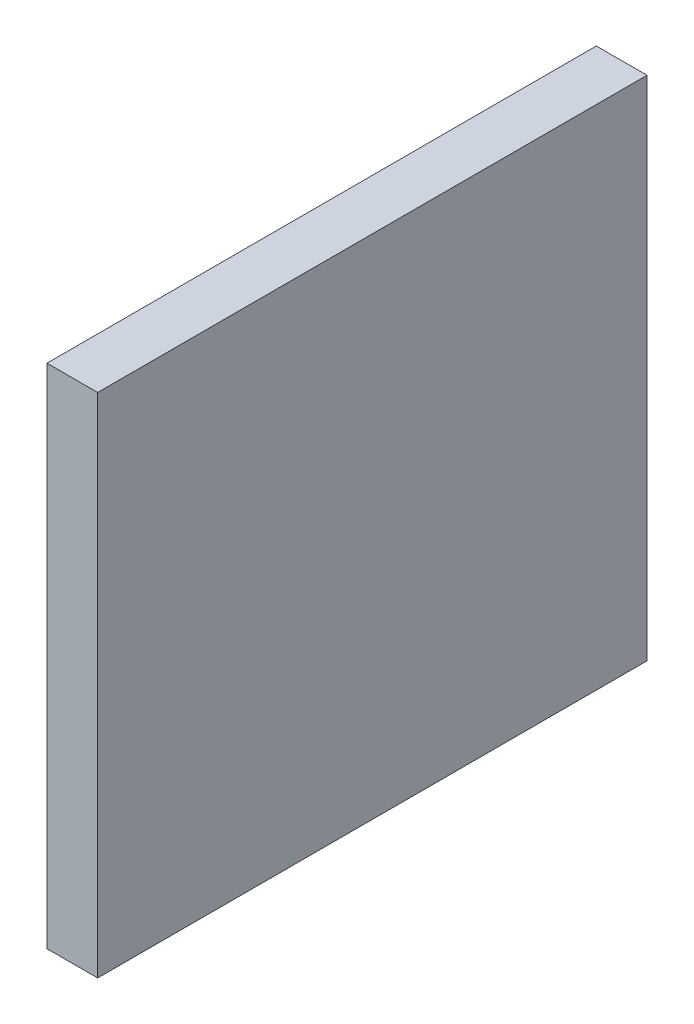
ISO-10303-21;
HEADER;
FILE_DESCRIPTION(('STEP AP214'),'2;1');
FILE_NAME('part.step','',(''),(''),'','','');
FILE_SCHEMA(('AUTOMOTIVE_DESIGN { 1 0 10303 214 1 1 1 1 }'));
ENDSEC;
DATA;
#1=APPLICATION_CONTEXT('core data for automotive mechanical design processes');
#2=APPLICATION_PROTOCOL_DEFINITION('international standard','automotive_design',2000,#1);
#3=PRODUCT_CONTEXT('',#1,'mechanical');
#4=PRODUCT('Part','Part','',(#3));
#5=PRODUCT_RELATED_PRODUCT_CATEGORY('part','',(#4));
#6=PRODUCT_DEFINITION_FORMATION('','',#4);
#7=PRODUCT_DEFINITION_CONTEXT('part definition',#1,'design');
#8=PRODUCT_DEFINITION('design','',#6,#7);
#9=PRODUCT_DEFINITION_SHAPE('','',#8);
#10=(LENGTH_UNIT() NAMED_UNIT(*) SI_UNIT(.MILLI.,.METRE.));
#11=(NAMED_UNIT(*) PLANE_ANGLE_UNIT() SI_UNIT($,.RADIAN.));
#12=(NAMED_UNIT(*) SI_UNIT($,.STERADIAN.) SOLID_ANGLE_UNIT());
#13=UNCERTAINTY_MEASURE_WITH_UNIT(LENGTH_MEASURE(1.E-05),#10,'distance_accuracy_value','');
#14=(GEOMETRIC_REPRESENTATION_CONTEXT(3) GLOBAL_UNCERTAINTY_ASSIGNED_CONTEXT((#13)) GLOBAL_UNIT_ASSIGNED_CONTEXT((#10,
#11,#12)) REPRESENTATION_CONTEXT('',''));
#15=CARTESIAN_POINT('',(0.,0.,0.));
#16=DIRECTION('',(0.,0.,1.));
#17=DIRECTION('',(1.,0.,0.));
#18=AXIS2_PLACEMENT_3D('',#15,#16,#17);
#19=CARTESIAN_POINT('',(-54.7428613620894,-30.,0.));
#20=DIRECTION('',(1.,0.,0.));
#21=DIRECTION('',(0.,0.,-1.));
#22=AXIS2_PLACEMENT_3D('',#19,#20,#21);
#23=PLANE('',#22);
#24=DIRECTION('',(0.,0.,-1.));
#25=VECTOR('',#24,1.);
#26=CARTESIAN_POINT('',(-54.7428613620894,0.,0.));
#27=LINE('',#26,#25);
#28=CARTESIAN_POINT('',(-54.7428613620894,0.,34.1761045562561));
#29=VERTEX_POINT('',#28);
#30=CARTESIAN_POINT('',(-54.7428613620894,0.,1.67610455625611));
#31=VERTEX_POINT('',#30);
#32=EDGE_CURVE('E98',#29,#31,#27,.T.);
#33=ORIENTED_EDGE('',*,*,#32,.T.);
#34=DIRECTION('',(0.,1.,0.));
#35=VECTOR('',#34,1.);
#36=CARTESIAN_POINT('',(-54.7428613620894,-30.,1.67610455625611));
#37=LINE('',#36,#35);
#38=CARTESIAN_POINT('',(-54.7428613620894,-30.,1.67610455625611));
#39=VERTEX_POINT('',#38);
#40=EDGE_CURVE('E11',#39,#31,#37,.T.);
#41=ORIENTED_EDGE('',*,*,#40,.F.);
#42=DIRECTION('',(0.,0.,-1.));
#43=VECTOR('',#42,1.);
#44=CARTESIAN_POINT('',(-54.7428613620894,-30.,0.));
#45=LINE('',#44,#43);
#46=CARTESIAN_POINT('',(-54.7428613620894,-30.,34.1761045562561));
#47=VERTEX_POINT('',#46);
#48=EDGE_CURVE('E53',#47,#39,#45,.T.);
#49=ORIENTED_EDGE('',*,*,#48,.F.);
#50=DIRECTION('',(0.,1.,0.));
#51=VECTOR('',#50,1.);
#52=CARTESIAN_POINT('',(-54.7428613620894,-30.,34.1761045562561));
#53=LINE('',#52,#51);
#54=EDGE_CURVE('E38',#47,#29,#53,.T.);
#55=ORIENTED_EDGE('',*,*,#54,.T.);
#56=EDGE_LOOP('',(#33,#41,#49,#55));
#57=FACE_BOUND('',#56,.T.);
#58=ADVANCED_FACE('F35',(#57),#23,.F.);
#59=CARTESIAN_POINT('',(0.,-30.,1.67610455625609));
#60=DIRECTION('',(0.,0.,-1.));
#61=DIRECTION('',(-1.,0.,0.));
#62=AXIS2_PLACEMENT_3D('',#59,#60,#61);
#63=PLANE('',#62);
#64=DIRECTION('',(-1.,0.,0.));
#65=VECTOR('',#64,1.);
#66=CARTESIAN_POINT('',(0.,0.,1.67610455625609));
#67=LINE('',#66,#65);
#68=CARTESIAN_POINT('',(-51.7428613620894,0.,1.6761045562561));
#69=VERTEX_POINT('',#68);
#70=EDGE_CURVE('E94',#69,#31,#67,.T.);
#71=ORIENTED_EDGE('',*,*,#70,.F.);
#72=DIRECTION('',(0.,1.,0.));
#73=VECTOR('',#72,1.);
#74=CARTESIAN_POINT('',(-51.7428613620894,-30.,1.6761045562561));
#75=LINE('',#74,#73);
#76=CARTESIAN_POINT('',(-51.7428613620894,-30.,1.6761045562561));
#77=VERTEX_POINT('',#76);
#78=EDGE_CURVE('E44',#77,#69,#75,.T.);
#79=ORIENTED_EDGE('',*,*,#78,.F.);
#80=DIRECTION('',(-1.,0.,0.));
#81=VECTOR('',#80,1.);
#82=CARTESIAN_POINT('',(0.,-30.,1.67610455625609));
#83=LINE('',#82,#81);
#84=EDGE_CURVE('E90',#77,#39,#83,.T.);
#85=ORIENTED_EDGE('',*,*,#84,.T.);
#86=ORIENTED_EDGE('',*,*,#40,.T.);
#87=EDGE_LOOP('',(#71,#79,#85,#86));
#88=FACE_BOUND('',#87,.T.);
#89=ADVANCED_FACE('F108',(#88),#63,.T.);
#90=CARTESIAN_POINT('',(-51.7428613620894,-30.,0.));
#91=DIRECTION('',(1.,0.,0.));
#92=DIRECTION('',(0.,0.,-1.));
#93=AXIS2_PLACEMENT_3D('',#90,#91,#92);
#94=PLANE('',#93);
#95=DIRECTION('',(0.,0.,-1.));
#96=VECTOR('',#95,1.);
#97=CARTESIAN_POINT('',(-51.7428613620894,0.,0.));
#98=LINE('',#97,#96);
#99=CARTESIAN_POINT('',(-51.7428613620894,0.,34.1761045562561));
#100=VERTEX_POINT('',#99);
#101=EDGE_CURVE('E86',#100,#69,#98,.T.);
#102=ORIENTED_EDGE('',*,*,#101,.F.);
#103=DIRECTION('',(0.,1.,0.));
#104=VECTOR('',#103,1.);
#105=CARTESIAN_POINT('',(-51.7428613620894,-30.,34.1761045562561));
#106=LINE('',#105,#104);
#107=CARTESIAN_POINT('',(-51.7428613620894,-30.,34.1761045562561));
#108=VERTEX_POINT('',#107);
#109=EDGE_CURVE('E82',#108,#100,#106,.T.);
#110=ORIENTED_EDGE('',*,*,#109,.F.);
#111=DIRECTION('',(0.,0.,-1.));
#112=VECTOR('',#111,1.);
#113=CARTESIAN_POINT('',(-51.7428613620894,-30.,0.));
#114=LINE('',#113,#112);
#115=EDGE_CURVE('E85',#108,#77,#114,.T.);
#116=ORIENTED_EDGE('',*,*,#115,.T.);
#117=ORIENTED_EDGE('',*,*,#78,.T.);
#118=EDGE_LOOP('',(#102,#110,#116,#117));
#119=FACE_BOUND('',#118,.T.);
#120=ADVANCED_FACE('F84',(#119),#94,.T.);
#121=CARTESIAN_POINT('',(0.,-30.,34.1761045562561));
#122=DIRECTION('',(0.,0.,1.));
#123=DIRECTION('',(1.,0.,0.));
#124=AXIS2_PLACEMENT_3D('',#121,#122,#123);
#125=PLANE('',#124);
#126=DIRECTION('',(1.,0.,0.));
#127=VECTOR('',#126,1.);
#128=CARTESIAN_POINT('',(0.,0.,34.1761045562561));
#129=LINE('',#128,#127);
#130=EDGE_CURVE('E100',#29,#100,#129,.T.);
#131=ORIENTED_EDGE('',*,*,#130,.F.);
#132=ORIENTED_EDGE('',*,*,#54,.F.);
#133=DIRECTION('',(1.,0.,0.));
#134=VECTOR('',#133,1.);
#135=CARTESIAN_POINT('',(0.,-30.,34.1761045562561));
#136=LINE('',#135,#134);
#137=EDGE_CURVE('E89',#47,#108,#136,.T.);
#138=ORIENTED_EDGE('',*,*,#137,.T.);
#139=ORIENTED_EDGE('',*,*,#109,.T.);
#140=EDGE_LOOP('',(#131,#132,#138,#139));
#141=FACE_BOUND('',#140,.T.);
#142=ADVANCED_FACE('F92',(#141),#125,.T.);
#143=CARTESIAN_POINT('',(0.,-30.,0.));
#144=DIRECTION('',(0.,1.,0.));
#145=DIRECTION('',(0.,0.,1.));
#146=AXIS2_PLACEMENT_3D('',#143,#144,#145);
#147=PLANE('',#146);
#148=ORIENTED_EDGE('',*,*,#48,.T.);
#149=ORIENTED_EDGE('',*,*,#84,.F.);
#150=ORIENTED_EDGE('',*,*,#115,.F.);
#151=ORIENTED_EDGE('',*,*,#137,.F.);
#152=EDGE_LOOP('',(#148,#149,#150,#151));
#153=FACE_BOUND('',#152,.T.);
#154=ADVANCED_FACE('F88',(#153),#147,.F.);
#155=CARTESIAN_POINT('',(0.,0.,0.));
#156=DIRECTION('',(0.,1.,0.));
#157=DIRECTION('',(0.,0.,1.));
#158=AXIS2_PLACEMENT_3D('',#155,#156,#157);
#159=PLANE('',#158);
#160=ORIENTED_EDGE('',*,*,#32,.F.);
#161=ORIENTED_EDGE('',*,*,#130,.T.);
#162=ORIENTED_EDGE('',*,*,#101,.T.);
#163=ORIENTED_EDGE('',*,*,#70,.T.);
#164=EDGE_LOOP('',(#160,#161,#162,#163));
#165=FACE_BOUND('',#164,.T.);
#166=ADVANCED_FACE('F107',(#165),#159,.T.);
#167=CLOSED_SHELL('',(#58,#89,#120,#142,#154,#166));
#168=MANIFOLD_SOLID_BREP('B2',#167);
#169=ADVANCED_BREP_SHAPE_REPRESENTATION('',(#18,#168),#14);
#170=SHAPE_DEFINITION_REPRESENTATION(#9,#169);
ENDSEC;
END-ISO-10303-21;
